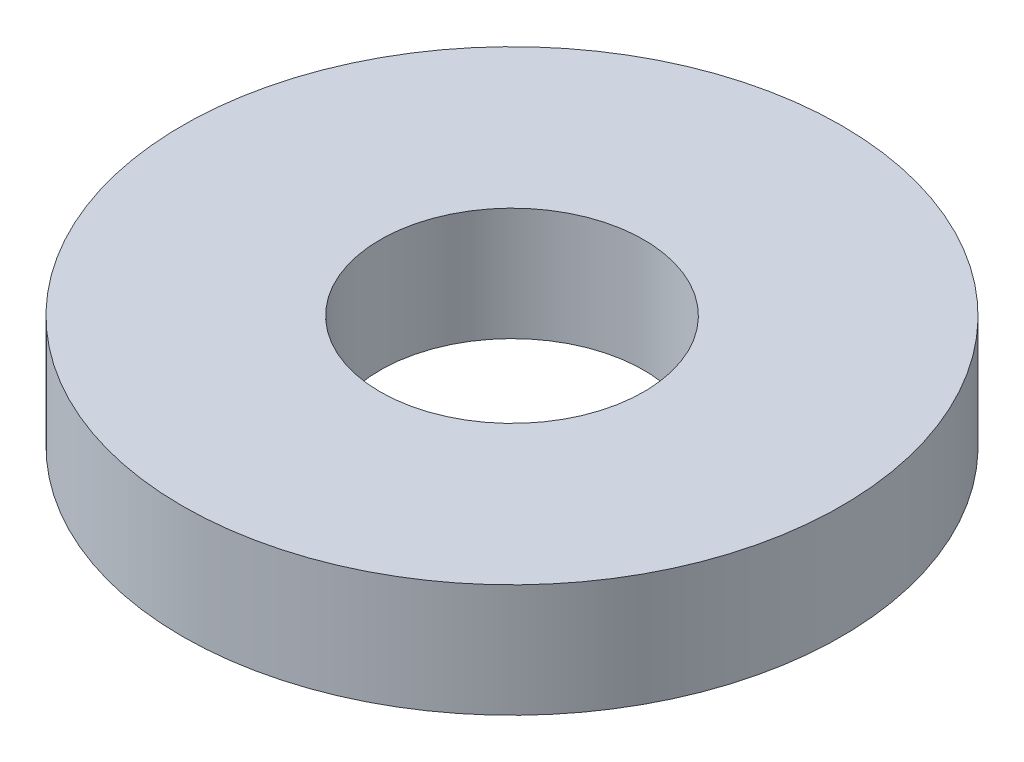
ISO-10303-21;
HEADER;
FILE_DESCRIPTION(('STEP AP214'),'2;1');
FILE_NAME('part.step','',(''),(''),'','','');
FILE_SCHEMA(('AUTOMOTIVE_DESIGN { 1 0 10303 214 1 1 1 1 }'));
ENDSEC;
DATA;
#1=APPLICATION_CONTEXT('core data for automotive mechanical design processes');
#2=APPLICATION_PROTOCOL_DEFINITION('international standard','automotive_design',2000,#1);
#3=PRODUCT_CONTEXT('',#1,'mechanical');
#4=PRODUCT('Part','Part','',(#3));
#5=PRODUCT_RELATED_PRODUCT_CATEGORY('part','',(#4));
#6=PRODUCT_DEFINITION_FORMATION('','',#4);
#7=PRODUCT_DEFINITION_CONTEXT('part definition',#1,'design');
#8=PRODUCT_DEFINITION('design','',#6,#7);
#9=PRODUCT_DEFINITION_SHAPE('','',#8);
#10=(LENGTH_UNIT() NAMED_UNIT(*) SI_UNIT(.MILLI.,.METRE.));
#11=(NAMED_UNIT(*) PLANE_ANGLE_UNIT() SI_UNIT($,.RADIAN.));
#12=(NAMED_UNIT(*) SI_UNIT($,.STERADIAN.) SOLID_ANGLE_UNIT());
#13=UNCERTAINTY_MEASURE_WITH_UNIT(LENGTH_MEASURE(1.E-05),#10,'distance_accuracy_value','');
#14=(GEOMETRIC_REPRESENTATION_CONTEXT(3) GLOBAL_UNCERTAINTY_ASSIGNED_CONTEXT((#13)) GLOBAL_UNIT_ASSIGNED_CONTEXT((#10,
#11,#12)) REPRESENTATION_CONTEXT('',''));
#15=CARTESIAN_POINT('',(0.,0.,0.));
#16=DIRECTION('',(0.,0.,1.));
#17=DIRECTION('',(1.,0.,0.));
#18=AXIS2_PLACEMENT_3D('',#15,#16,#17);
#19=CARTESIAN_POINT('',(0.,30.,0.));
#20=DIRECTION('',(0.,-1.,0.));
#21=DIRECTION('',(0.,0.,-1.));
#22=AXIS2_PLACEMENT_3D('',#19,#20,#21);
#23=CYLINDRICAL_SURFACE('',#22,87.5);
#24=CARTESIAN_POINT('',(0.,30.,0.));
#25=DIRECTION('',(0.,1.,0.));
#26=DIRECTION('',(0.,0.,1.));
#27=AXIS2_PLACEMENT_3D('',#24,#25,#26);
#28=CIRCLE('',#27,87.5);
#29=CARTESIAN_POINT('',(0.,30.,87.5));
#30=VERTEX_POINT('',#29);
#31=EDGE_CURVE('E10',#30,#30,#28,.T.);
#32=ORIENTED_EDGE('',*,*,#31,.F.);
#33=EDGE_LOOP('',(#32));
#34=FACE_BOUND('',#33,.T.);
#35=CARTESIAN_POINT('',(0.,0.,0.));
#36=DIRECTION('',(0.,1.,0.));
#37=DIRECTION('',(0.,0.,1.));
#38=AXIS2_PLACEMENT_3D('',#35,#36,#37);
#39=CIRCLE('',#38,87.5);
#40=CARTESIAN_POINT('',(0.,0.,87.5));
#41=VERTEX_POINT('',#40);
#42=EDGE_CURVE('E37',#41,#41,#39,.T.);
#43=ORIENTED_EDGE('',*,*,#42,.T.);
#44=EDGE_LOOP('',(#43));
#45=FACE_BOUND('',#44,.T.);
#46=ADVANCED_FACE('F40',(#34,#45),#23,.T.);
#47=CARTESIAN_POINT('',(0.,30.,0.));
#48=DIRECTION('',(0.,1.,0.));
#49=DIRECTION('',(0.,0.,1.));
#50=AXIS2_PLACEMENT_3D('',#47,#48,#49);
#51=PLANE('',#50);
#52=CARTESIAN_POINT('',(0.,30.,0.));
#53=DIRECTION('',(0.,1.,0.));
#54=DIRECTION('',(0.,0.,1.));
#55=AXIS2_PLACEMENT_3D('',#52,#53,#54);
#56=CIRCLE('',#55,35.);
#57=CARTESIAN_POINT('',(0.,30.,35.));
#58=VERTEX_POINT('',#57);
#59=EDGE_CURVE('E50',#58,#58,#56,.T.);
#60=ORIENTED_EDGE('',*,*,#59,.F.);
#61=EDGE_LOOP('',(#60));
#62=FACE_BOUND('',#61,.T.);
#63=ORIENTED_EDGE('',*,*,#31,.T.);
#64=EDGE_LOOP('',(#63));
#65=FACE_BOUND('',#64,.T.);
#66=ADVANCED_FACE('F59',(#62,#65),#51,.T.);
#67=CARTESIAN_POINT('',(0.,0.,0.));
#68=DIRECTION('',(0.,1.,0.));
#69=DIRECTION('',(0.,0.,1.));
#70=AXIS2_PLACEMENT_3D('',#67,#68,#69);
#71=PLANE('',#70);
#72=CARTESIAN_POINT('',(0.,0.,0.));
#73=DIRECTION('',(0.,1.,0.));
#74=DIRECTION('',(0.,0.,1.));
#75=AXIS2_PLACEMENT_3D('',#72,#73,#74);
#76=CIRCLE('',#75,35.);
#77=CARTESIAN_POINT('',(0.,0.,35.));
#78=VERTEX_POINT('',#77);
#79=EDGE_CURVE('E47',#78,#78,#76,.T.);
#80=ORIENTED_EDGE('',*,*,#79,.T.);
#81=EDGE_LOOP('',(#80));
#82=FACE_BOUND('',#81,.T.);
#83=ORIENTED_EDGE('',*,*,#42,.F.);
#84=EDGE_LOOP('',(#83));
#85=FACE_BOUND('',#84,.T.);
#86=ADVANCED_FACE('F58',(#82,#85),#71,.F.);
#87=CARTESIAN_POINT('',(0.,30.,0.));
#88=DIRECTION('',(0.,-1.,0.));
#89=DIRECTION('',(0.,0.,-1.));
#90=AXIS2_PLACEMENT_3D('',#87,#88,#89);
#91=CYLINDRICAL_SURFACE('',#90,35.);
#92=ORIENTED_EDGE('',*,*,#59,.T.);
#93=EDGE_LOOP('',(#92));
#94=FACE_BOUND('',#93,.T.);
#95=ORIENTED_EDGE('',*,*,#79,.F.);
#96=EDGE_LOOP('',(#95));
#97=FACE_BOUND('',#96,.T.);
#98=ADVANCED_FACE('F54',(#94,#97),#91,.F.);
#99=CLOSED_SHELL('',(#46,#66,#86,#98));
#100=MANIFOLD_SOLID_BREP('B2',#99);
#101=ADVANCED_BREP_SHAPE_REPRESENTATION('',(#18,#100),#14);
#102=SHAPE_DEFINITION_REPRESENTATION(#9,#101);
ENDSEC;
END-ISO-10303-21;
